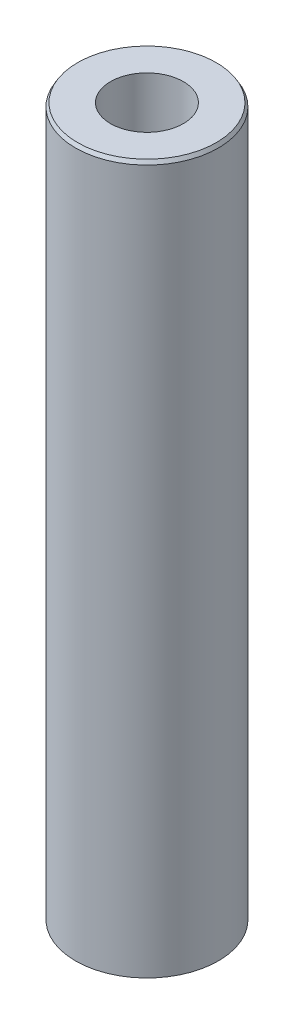
ISO-10303-21;
HEADER;
FILE_DESCRIPTION(('STEP AP214'),'2;1');
FILE_NAME('part.step','',(''),(''),'','','');
FILE_SCHEMA(('AUTOMOTIVE_DESIGN { 1 0 10303 214 1 1 1 1 }'));
ENDSEC;
DATA;
#1=APPLICATION_CONTEXT('core data for automotive mechanical design processes');
#2=APPLICATION_PROTOCOL_DEFINITION('international standard','automotive_design',2000,#1);
#3=PRODUCT_CONTEXT('',#1,'mechanical');
#4=PRODUCT('Part','Part','',(#3));
#5=PRODUCT_RELATED_PRODUCT_CATEGORY('part','',(#4));
#6=PRODUCT_DEFINITION_FORMATION('','',#4);
#7=PRODUCT_DEFINITION_CONTEXT('part definition',#1,'design');
#8=PRODUCT_DEFINITION('design','',#6,#7);
#9=PRODUCT_DEFINITION_SHAPE('','',#8);
#10=(LENGTH_UNIT() NAMED_UNIT(*) SI_UNIT(.MILLI.,.METRE.));
#11=(NAMED_UNIT(*) PLANE_ANGLE_UNIT() SI_UNIT($,.RADIAN.));
#12=(NAMED_UNIT(*) SI_UNIT($,.STERADIAN.) SOLID_ANGLE_UNIT());
#13=UNCERTAINTY_MEASURE_WITH_UNIT(LENGTH_MEASURE(1.E-05),#10,'distance_accuracy_value','');
#14=(GEOMETRIC_REPRESENTATION_CONTEXT(3) GLOBAL_UNCERTAINTY_ASSIGNED_CONTEXT((#13)) GLOBAL_UNIT_ASSIGNED_CONTEXT((#10,
#11,#12)) REPRESENTATION_CONTEXT('',''));
#15=CARTESIAN_POINT('',(0.,0.,0.));
#16=DIRECTION('',(0.,0.,1.));
#17=DIRECTION('',(1.,0.,0.));
#18=AXIS2_PLACEMENT_3D('',#15,#16,#17);
#19=CARTESIAN_POINT('',(0.,471.975598878968,0.));
#20=DIRECTION('',(0.,-1.,0.));
#21=DIRECTION('',(0.,0.,-1.));
#22=AXIS2_PLACEMENT_3D('',#19,#20,#21);
#23=CYLINDRICAL_SURFACE('',#22,47.5);
#24=CARTESIAN_POINT('',(0.,469.563216793775,0.));
#25=DIRECTION('',(0.,1.,0.));
#26=DIRECTION('',(0.,0.,1.));
#27=AXIS2_PLACEMENT_3D('',#24,#25,#26);
#28=CIRCLE('',#27,47.5);
#29=CARTESIAN_POINT('',(0.,469.563216793775,47.5));
#30=VERTEX_POINT('',#29);
#31=EDGE_CURVE('E50',#30,#30,#28,.F.);
#32=ORIENTED_EDGE('',*,*,#31,.T.);
#33=EDGE_LOOP('',(#32));
#34=FACE_BOUND('',#33,.T.);
#35=CARTESIAN_POINT('',(0.,1.39278944627458,0.));
#36=DIRECTION('',(0.,1.,0.));
#37=DIRECTION('',(0.,0.,1.));
#38=AXIS2_PLACEMENT_3D('',#35,#36,#37);
#39=CIRCLE('',#38,47.5);
#40=CARTESIAN_POINT('',(0.,1.39278944627458,47.5));
#41=VERTEX_POINT('',#40);
#42=EDGE_CURVE('E51',#41,#41,#39,.T.);
#43=ORIENTED_EDGE('',*,*,#42,.T.);
#44=EDGE_LOOP('',(#43));
#45=FACE_BOUND('',#44,.T.);
#46=ADVANCED_FACE('F39',(#34,#45),#23,.T.);
#47=CARTESIAN_POINT('',(0.,471.975598878968,0.));
#48=DIRECTION('',(0.,1.,0.));
#49=DIRECTION('',(0.,0.,1.));
#50=AXIS2_PLACEMENT_3D('',#47,#48,#49);
#51=PLANE('',#50);
#52=CARTESIAN_POINT('',(0.,471.975598878968,0.));
#53=DIRECTION('',(0.,1.,0.));
#54=DIRECTION('',(0.,0.,1.));
#55=AXIS2_PLACEMENT_3D('',#52,#53,#54);
#56=CIRCLE('',#55,46.1072105537256);
#57=CARTESIAN_POINT('',(0.,471.975598878968,46.1072105537256));
#58=VERTEX_POINT('',#57);
#59=EDGE_CURVE('E54',#58,#58,#56,.T.);
#60=ORIENTED_EDGE('',*,*,#59,.T.);
#61=EDGE_LOOP('',(#60));
#62=FACE_BOUND('',#61,.T.);
#63=CARTESIAN_POINT('',(0.,471.975598878968,0.));
#64=DIRECTION('',(0.,1.,0.));
#65=DIRECTION('',(0.,0.,1.));
#66=AXIS2_PLACEMENT_3D('',#63,#64,#65);
#67=CIRCLE('',#66,24.2294902946596);
#68=CARTESIAN_POINT('',(0.,471.975598878968,24.2294902946596));
#69=VERTEX_POINT('',#68);
#70=EDGE_CURVE('E58',#69,#69,#67,.T.);
#71=ORIENTED_EDGE('',*,*,#70,.F.);
#72=EDGE_LOOP('',(#71));
#73=FACE_BOUND('',#72,.T.);
#74=ADVANCED_FACE('F69',(#62,#73),#51,.T.);
#75=CARTESIAN_POINT('',(0.,0.,0.));
#76=DIRECTION('',(0.,1.,0.));
#77=DIRECTION('',(0.,0.,1.));
#78=AXIS2_PLACEMENT_3D('',#75,#76,#77);
#79=PLANE('',#78);
#80=CARTESIAN_POINT('',(0.,0.,0.));
#81=DIRECTION('',(0.,1.,0.));
#82=DIRECTION('',(0.,0.,1.));
#83=AXIS2_PLACEMENT_3D('',#80,#81,#82);
#84=CIRCLE('',#83,45.0876179148068);
#85=CARTESIAN_POINT('',(0.,0.,45.0876179148068));
#86=VERTEX_POINT('',#85);
#87=EDGE_CURVE('E10',#86,#86,#84,.F.);
#88=ORIENTED_EDGE('',*,*,#87,.T.);
#89=EDGE_LOOP('',(#88));
#90=FACE_BOUND('',#89,.T.);
#91=CARTESIAN_POINT('',(0.,0.,0.));
#92=DIRECTION('',(0.,1.,0.));
#93=DIRECTION('',(0.,0.,1.));
#94=AXIS2_PLACEMENT_3D('',#91,#92,#93);
#95=CIRCLE('',#94,24.2294902946596);
#96=CARTESIAN_POINT('',(0.,0.,24.2294902946596));
#97=VERTEX_POINT('',#96);
#98=EDGE_CURVE('E63',#97,#97,#95,.T.);
#99=ORIENTED_EDGE('',*,*,#98,.T.);
#100=EDGE_LOOP('',(#99));
#101=FACE_BOUND('',#100,.T.);
#102=ADVANCED_FACE('F75',(#90,#101),#79,.F.);
#103=CARTESIAN_POINT('',(0.,471.975598878968,0.));
#104=DIRECTION('',(0.,-1.,0.));
#105=DIRECTION('',(0.,0.,-1.));
#106=AXIS2_PLACEMENT_3D('',#103,#104,#105);
#107=CYLINDRICAL_SURFACE('',#106,24.2294902946596);
#108=ORIENTED_EDGE('',*,*,#70,.T.);
#109=EDGE_LOOP('',(#108));
#110=FACE_BOUND('',#109,.T.);
#111=ORIENTED_EDGE('',*,*,#98,.F.);
#112=EDGE_LOOP('',(#111));
#113=FACE_BOUND('',#112,.T.);
#114=ADVANCED_FACE('F70',(#110,#113),#107,.F.);
#115=CARTESIAN_POINT('',(0.,471.975598878968,0.));
#116=DIRECTION('',(0.,-1.,0.));
#117=DIRECTION('',(0.,0.,-1.));
#118=AXIS2_PLACEMENT_3D('',#115,#116,#117);
#119=CONICAL_SURFACE('',#118,46.1072105537256,0.523598775598304);
#120=ORIENTED_EDGE('',*,*,#31,.F.);
#121=EDGE_LOOP('',(#120));
#122=FACE_BOUND('',#121,.T.);
#123=ORIENTED_EDGE('',*,*,#59,.F.);
#124=EDGE_LOOP('',(#123));
#125=FACE_BOUND('',#124,.T.);
#126=ADVANCED_FACE('F81',(#122,#125),#119,.T.);
#127=CARTESIAN_POINT('',(0.,1.39278944627458,0.));
#128=DIRECTION('',(0.,1.,0.));
#129=DIRECTION('',(0.,0.,1.));
#130=AXIS2_PLACEMENT_3D('',#127,#128,#129);
#131=CONICAL_SURFACE('',#130,47.5,1.04719755119659);
#132=ORIENTED_EDGE('',*,*,#87,.F.);
#133=EDGE_LOOP('',(#132));
#134=FACE_BOUND('',#133,.T.);
#135=ORIENTED_EDGE('',*,*,#42,.F.);
#136=EDGE_LOOP('',(#135));
#137=FACE_BOUND('',#136,.T.);
#138=ADVANCED_FACE('F45',(#134,#137),#131,.T.);
#139=CLOSED_SHELL('',(#46,#74,#102,#114,#126,#138));
#140=MANIFOLD_SOLID_BREP('B2',#139);
#141=ADVANCED_BREP_SHAPE_REPRESENTATION('',(#18,#140),#14);
#142=SHAPE_DEFINITION_REPRESENTATION(#9,#141);
ENDSEC;
END-ISO-10303-21;
